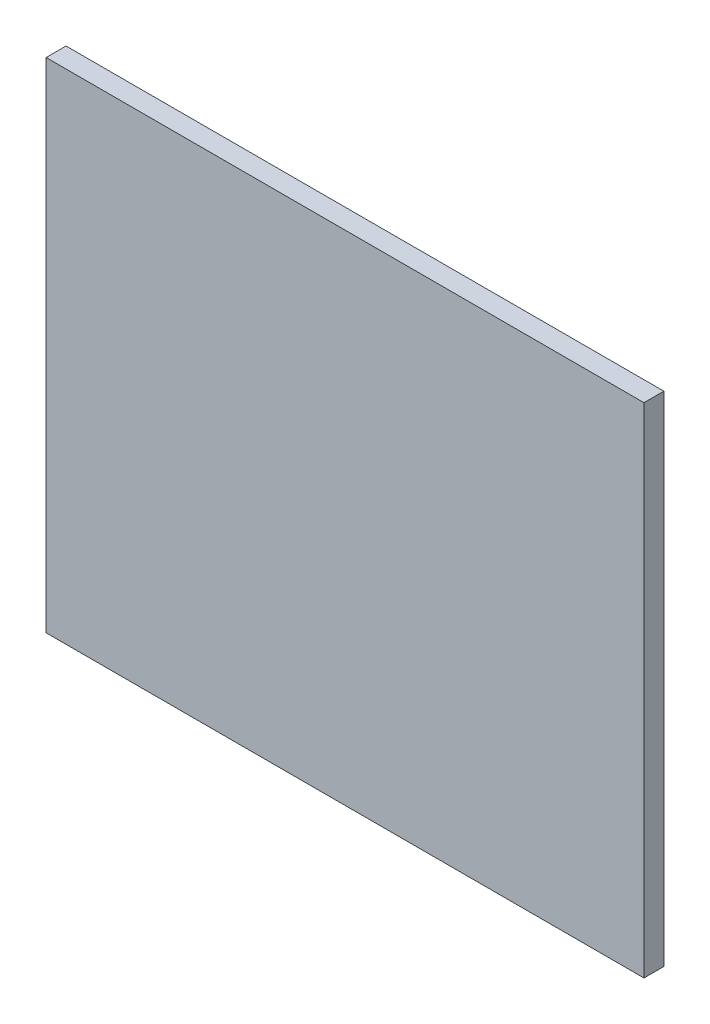
ISO-10303-21;
HEADER;
FILE_DESCRIPTION(('STEP AP214'),'2;1');
FILE_NAME('part.step','',(''),(''),'','','');
FILE_SCHEMA(('AUTOMOTIVE_DESIGN { 1 0 10303 214 1 1 1 1 }'));
ENDSEC;
DATA;
#1=APPLICATION_CONTEXT('core data for automotive mechanical design processes');
#2=APPLICATION_PROTOCOL_DEFINITION('international standard','automotive_design',2000,#1);
#3=PRODUCT_CONTEXT('',#1,'mechanical');
#4=PRODUCT('Part','Part','',(#3));
#5=PRODUCT_RELATED_PRODUCT_CATEGORY('part','',(#4));
#6=PRODUCT_DEFINITION_FORMATION('','',#4);
#7=PRODUCT_DEFINITION_CONTEXT('part definition',#1,'design');
#8=PRODUCT_DEFINITION('design','',#6,#7);
#9=PRODUCT_DEFINITION_SHAPE('','',#8);
#10=(LENGTH_UNIT() NAMED_UNIT(*) SI_UNIT(.MILLI.,.METRE.));
#11=(NAMED_UNIT(*) PLANE_ANGLE_UNIT() SI_UNIT($,.RADIAN.));
#12=(NAMED_UNIT(*) SI_UNIT($,.STERADIAN.) SOLID_ANGLE_UNIT());
#13=UNCERTAINTY_MEASURE_WITH_UNIT(LENGTH_MEASURE(1.E-05),#10,'distance_accuracy_value','');
#14=(GEOMETRIC_REPRESENTATION_CONTEXT(3) GLOBAL_UNCERTAINTY_ASSIGNED_CONTEXT((#13)) GLOBAL_UNIT_ASSIGNED_CONTEXT((#10,
#11,#12)) REPRESENTATION_CONTEXT('',''));
#15=CARTESIAN_POINT('',(0.,0.,0.));
#16=DIRECTION('',(0.,0.,1.));
#17=DIRECTION('',(1.,0.,0.));
#18=AXIS2_PLACEMENT_3D('',#15,#16,#17);
#19=CARTESIAN_POINT('',(0.,0.,-5.));
#20=DIRECTION('',(-1.,0.,0.));
#21=DIRECTION('',(0.,0.,1.));
#22=AXIS2_PLACEMENT_3D('',#19,#20,#21);
#23=PLANE('',#22);
#24=DIRECTION('',(0.,-1.,0.));
#25=VECTOR('',#24,1.);
#26=CARTESIAN_POINT('',(0.,0.,0.));
#27=LINE('',#26,#25);
#28=CARTESIAN_POINT('',(0.,125.,0.));
#29=VERTEX_POINT('',#28);
#30=CARTESIAN_POINT('',(0.,0.,0.));
#31=VERTEX_POINT('',#30);
#32=EDGE_CURVE('E110',#29,#31,#27,.T.);
#33=ORIENTED_EDGE('',*,*,#32,.F.);
#34=DIRECTION('',(0.,0.,1.));
#35=VECTOR('',#34,1.);
#36=CARTESIAN_POINT('',(0.,125.,-5.));
#37=LINE('',#36,#35);
#38=CARTESIAN_POINT('',(0.,125.,-5.));
#39=VERTEX_POINT('',#38);
#40=EDGE_CURVE('E11',#39,#29,#37,.T.);
#41=ORIENTED_EDGE('',*,*,#40,.F.);
#42=DIRECTION('',(0.,-1.,0.));
#43=VECTOR('',#42,1.);
#44=CARTESIAN_POINT('',(0.,0.,-5.));
#45=LINE('',#44,#43);
#46=CARTESIAN_POINT('',(0.,0.,-5.));
#47=VERTEX_POINT('',#46);
#48=EDGE_CURVE('E102',#39,#47,#45,.T.);
#49=ORIENTED_EDGE('',*,*,#48,.T.);
#50=DIRECTION('',(0.,0.,1.));
#51=VECTOR('',#50,1.);
#52=CARTESIAN_POINT('',(0.,0.,-5.));
#53=LINE('',#52,#51);
#54=EDGE_CURVE('E43',#47,#31,#53,.T.);
#55=ORIENTED_EDGE('',*,*,#54,.T.);
#56=EDGE_LOOP('',(#33,#41,#49,#55));
#57=FACE_BOUND('',#56,.T.);
#58=ADVANCED_FACE('F40',(#57),#23,.T.);
#59=CARTESIAN_POINT('',(0.,125.,-5.));
#60=DIRECTION('',(0.,1.,0.));
#61=DIRECTION('',(0.,0.,1.));
#62=AXIS2_PLACEMENT_3D('',#59,#60,#61);
#63=PLANE('',#62);
#64=DIRECTION('',(-1.,0.,0.));
#65=VECTOR('',#64,1.);
#66=CARTESIAN_POINT('',(0.,125.,0.));
#67=LINE('',#66,#65);
#68=CARTESIAN_POINT('',(150.,125.,0.));
#69=VERTEX_POINT('',#68);
#70=EDGE_CURVE('E105',#69,#29,#67,.T.);
#71=ORIENTED_EDGE('',*,*,#70,.F.);
#72=DIRECTION('',(0.,0.,1.));
#73=VECTOR('',#72,1.);
#74=CARTESIAN_POINT('',(150.,125.,-5.));
#75=LINE('',#74,#73);
#76=CARTESIAN_POINT('',(150.,125.,-5.));
#77=VERTEX_POINT('',#76);
#78=EDGE_CURVE('E50',#77,#69,#75,.T.);
#79=ORIENTED_EDGE('',*,*,#78,.F.);
#80=DIRECTION('',(-1.,0.,0.));
#81=VECTOR('',#80,1.);
#82=CARTESIAN_POINT('',(0.,125.,-5.));
#83=LINE('',#82,#81);
#84=EDGE_CURVE('E97',#77,#39,#83,.T.);
#85=ORIENTED_EDGE('',*,*,#84,.T.);
#86=ORIENTED_EDGE('',*,*,#40,.T.);
#87=EDGE_LOOP('',(#71,#79,#85,#86));
#88=FACE_BOUND('',#87,.T.);
#89=ADVANCED_FACE('F126',(#88),#63,.T.);
#90=CARTESIAN_POINT('',(150.,0.,-5.));
#91=DIRECTION('',(1.,0.,0.));
#92=DIRECTION('',(0.,0.,-1.));
#93=AXIS2_PLACEMENT_3D('',#90,#91,#92);
#94=PLANE('',#93);
#95=DIRECTION('',(0.,1.,0.));
#96=VECTOR('',#95,1.);
#97=CARTESIAN_POINT('',(150.,0.,0.));
#98=LINE('',#97,#96);
#99=CARTESIAN_POINT('',(150.,0.,0.));
#100=VERTEX_POINT('',#99);
#101=EDGE_CURVE('E91',#100,#69,#98,.T.);
#102=ORIENTED_EDGE('',*,*,#101,.F.);
#103=DIRECTION('',(0.,0.,1.));
#104=VECTOR('',#103,1.);
#105=CARTESIAN_POINT('',(150.,0.,-5.));
#106=LINE('',#105,#104);
#107=CARTESIAN_POINT('',(150.,0.,-5.));
#108=VERTEX_POINT('',#107);
#109=EDGE_CURVE('E86',#108,#100,#106,.T.);
#110=ORIENTED_EDGE('',*,*,#109,.F.);
#111=DIRECTION('',(0.,1.,0.));
#112=VECTOR('',#111,1.);
#113=CARTESIAN_POINT('',(150.,0.,-5.));
#114=LINE('',#113,#112);
#115=EDGE_CURVE('E89',#108,#77,#114,.T.);
#116=ORIENTED_EDGE('',*,*,#115,.T.);
#117=ORIENTED_EDGE('',*,*,#78,.T.);
#118=EDGE_LOOP('',(#102,#110,#116,#117));
#119=FACE_BOUND('',#118,.T.);
#120=ADVANCED_FACE('F88',(#119),#94,.T.);
#121=CARTESIAN_POINT('',(0.,0.,-5.));
#122=DIRECTION('',(0.,-1.,0.));
#123=DIRECTION('',(0.,0.,-1.));
#124=AXIS2_PLACEMENT_3D('',#121,#122,#123);
#125=PLANE('',#124);
#126=DIRECTION('',(1.,0.,0.));
#127=VECTOR('',#126,1.);
#128=CARTESIAN_POINT('',(0.,0.,0.));
#129=LINE('',#128,#127);
#130=EDGE_CURVE('E114',#31,#100,#129,.T.);
#131=ORIENTED_EDGE('',*,*,#130,.F.);
#132=ORIENTED_EDGE('',*,*,#54,.F.);
#133=DIRECTION('',(1.,0.,0.));
#134=VECTOR('',#133,1.);
#135=CARTESIAN_POINT('',(0.,0.,-5.));
#136=LINE('',#135,#134);
#137=EDGE_CURVE('E96',#47,#108,#136,.T.);
#138=ORIENTED_EDGE('',*,*,#137,.T.);
#139=ORIENTED_EDGE('',*,*,#109,.T.);
#140=EDGE_LOOP('',(#131,#132,#138,#139));
#141=FACE_BOUND('',#140,.T.);
#142=ADVANCED_FACE('F100',(#141),#125,.T.);
#143=CARTESIAN_POINT('',(0.,0.,-5.));
#144=DIRECTION('',(0.,0.,-1.));
#145=DIRECTION('',(-1.,0.,0.));
#146=AXIS2_PLACEMENT_3D('',#143,#144,#145);
#147=PLANE('',#146);
#148=ORIENTED_EDGE('',*,*,#48,.F.);
#149=ORIENTED_EDGE('',*,*,#84,.F.);
#150=ORIENTED_EDGE('',*,*,#115,.F.);
#151=ORIENTED_EDGE('',*,*,#137,.F.);
#152=EDGE_LOOP('',(#148,#149,#150,#151));
#153=FACE_BOUND('',#152,.T.);
#154=ADVANCED_FACE('F95',(#153),#147,.T.);
#155=CARTESIAN_POINT('',(0.,0.,0.));
#156=DIRECTION('',(0.,0.,-1.));
#157=DIRECTION('',(-1.,0.,0.));
#158=AXIS2_PLACEMENT_3D('',#155,#156,#157);
#159=PLANE('',#158);
#160=ORIENTED_EDGE('',*,*,#32,.T.);
#161=ORIENTED_EDGE('',*,*,#130,.T.);
#162=ORIENTED_EDGE('',*,*,#101,.T.);
#163=ORIENTED_EDGE('',*,*,#70,.T.);
#164=EDGE_LOOP('',(#160,#161,#162,#163));
#165=FACE_BOUND('',#164,.T.);
#166=ADVANCED_FACE('F125',(#165),#159,.F.);
#167=CLOSED_SHELL('',(#58,#89,#120,#142,#154,#166));
#168=MANIFOLD_SOLID_BREP('B2',#167);
#169=ADVANCED_BREP_SHAPE_REPRESENTATION('',(#18,#168),#14);
#170=SHAPE_DEFINITION_REPRESENTATION(#9,#169);
ENDSEC;
END-ISO-10303-21;
